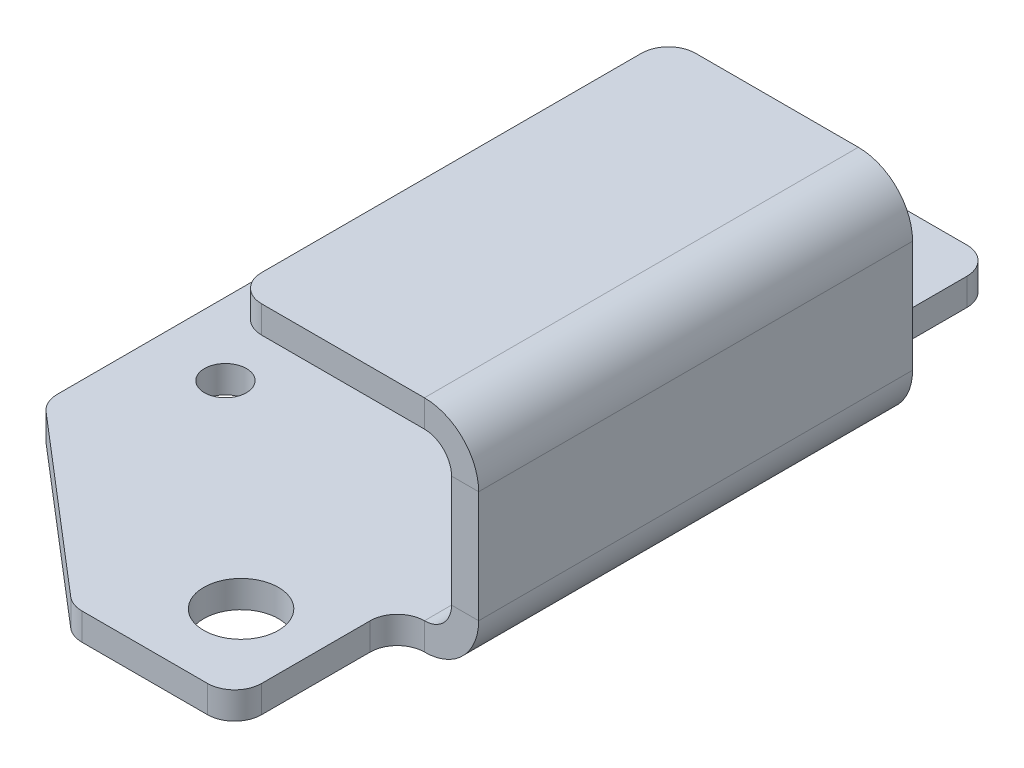
ISO-10303-21;
HEADER;
FILE_DESCRIPTION(('STEP AP214'),'2;1');
FILE_NAME('part.step','',(''),(''),'','','');
FILE_SCHEMA(('AUTOMOTIVE_DESIGN { 1 0 10303 214 1 1 1 1 }'));
ENDSEC;
DATA;
#1=APPLICATION_CONTEXT('core data for automotive mechanical design processes');
#2=APPLICATION_PROTOCOL_DEFINITION('international standard','automotive_design',2000,#1);
#3=PRODUCT_CONTEXT('',#1,'mechanical');
#4=PRODUCT('Part','Part','',(#3));
#5=PRODUCT_RELATED_PRODUCT_CATEGORY('part','',(#4));
#6=PRODUCT_DEFINITION_FORMATION('','',#4);
#7=PRODUCT_DEFINITION_CONTEXT('part definition',#1,'design');
#8=PRODUCT_DEFINITION('design','',#6,#7);
#9=PRODUCT_DEFINITION_SHAPE('','',#8);
#10=(LENGTH_UNIT() NAMED_UNIT(*) SI_UNIT(.MILLI.,.METRE.));
#11=(NAMED_UNIT(*) PLANE_ANGLE_UNIT() SI_UNIT($,.RADIAN.));
#12=(NAMED_UNIT(*) SI_UNIT($,.STERADIAN.) SOLID_ANGLE_UNIT());
#13=UNCERTAINTY_MEASURE_WITH_UNIT(LENGTH_MEASURE(1.E-05),#10,'distance_accuracy_value','');
#14=(GEOMETRIC_REPRESENTATION_CONTEXT(3) GLOBAL_UNCERTAINTY_ASSIGNED_CONTEXT((#13)) GLOBAL_UNIT_ASSIGNED_CONTEXT((#10,
#11,#12)) REPRESENTATION_CONTEXT('',''));
#15=CARTESIAN_POINT('',(0.,0.,0.));
#16=DIRECTION('',(0.,0.,1.));
#17=DIRECTION('',(1.,0.,0.));
#18=AXIS2_PLACEMENT_3D('',#15,#16,#17);
#19=CARTESIAN_POINT('',(25.4,-19.431,25.4));
#20=DIRECTION('',(0.,-1.,0.));
#21=DIRECTION('',(1.,0.,0.));
#22=AXIS2_PLACEMENT_3D('',#19,#20,#21);
#23=PLANE('',#22);
#24=CARTESIAN_POINT('',(-13.7668,-19.431,12.7));
#25=DIRECTION('',(0.,1.,0.));
#26=DIRECTION('',(-1.,0.,0.));
#27=AXIS2_PLACEMENT_3D('',#24,#25,#26);
#28=CIRCLE('',#27,2.45745);
#29=CARTESIAN_POINT('',(-16.22425,-19.431,12.7));
#30=VERTEX_POINT('',#29);
#31=EDGE_CURVE('E887',#30,#30,#28,.T.);
#32=ORIENTED_EDGE('',*,*,#31,.F.);
#33=EDGE_LOOP('',(#32));
#34=FACE_BOUND('',#33,.T.);
#35=CARTESIAN_POINT('',(-13.7668,-19.431,-12.7));
#36=DIRECTION('',(0.,1.,0.));
#37=DIRECTION('',(-1.,0.,0.));
#38=AXIS2_PLACEMENT_3D('',#35,#36,#37);
#39=CIRCLE('',#38,2.45745);
#40=CARTESIAN_POINT('',(-16.22425,-19.431,-12.7));
#41=VERTEX_POINT('',#40);
#42=EDGE_CURVE('E893',#41,#41,#39,.T.);
#43=ORIENTED_EDGE('',*,*,#42,.F.);
#44=EDGE_LOOP('',(#43));
#45=FACE_BOUND('',#44,.T.);
#46=CARTESIAN_POINT('',(10.287,-19.431,34.925));
#47=DIRECTION('',(0.,1.,0.));
#48=DIRECTION('',(-1.,0.,0.));
#49=AXIS2_PLACEMENT_3D('',#46,#47,#48);
#50=CIRCLE('',#49,4.36880000000001);
#51=CARTESIAN_POINT('',(5.9182,-19.431,34.925));
#52=VERTEX_POINT('',#51);
#53=EDGE_CURVE('E935',#52,#52,#50,.T.);
#54=ORIENTED_EDGE('',*,*,#53,.F.);
#55=EDGE_LOOP('',(#54));
#56=FACE_BOUND('',#55,.T.);
#57=CARTESIAN_POINT('',(10.287,-19.431,-34.925));
#58=DIRECTION('',(0.,1.,0.));
#59=DIRECTION('',(-1.,0.,0.));
#60=AXIS2_PLACEMENT_3D('',#57,#58,#59);
#61=CIRCLE('',#60,4.36879999999999);
#62=CARTESIAN_POINT('',(5.91820000000002,-19.431,-34.925));
#63=VERTEX_POINT('',#62);
#64=EDGE_CURVE('E922',#63,#63,#61,.T.);
#65=ORIENTED_EDGE('',*,*,#64,.F.);
#66=EDGE_LOOP('',(#65));
#67=FACE_BOUND('',#66,.T.);
#68=DIRECTION('',(0.759256602365297,0.,0.650791373455969));
#69=VECTOR('',#68,1.);
#70=CARTESIAN_POINT('',(-21.9635294117647,-19.431,25.6241176470588));
#71=LINE('',#70,#69);
#72=CARTESIAN_POINT('',(-21.1162626107227,-19.431,26.3503463336663));
#73=VERTEX_POINT('',#72);
#74=CARTESIAN_POINT('',(-0.891753668738532,-19.431,43.6856397125098));
#75=VERTEX_POINT('',#74);
#76=EDGE_CURVE('E915',#73,#75,#71,.T.);
#77=ORIENTED_EDGE('',*,*,#76,.T.);
#78=CARTESIAN_POINT('',(1.17450894198416,-19.431,41.275));
#79=DIRECTION('',(0.,-1.,0.));
#80=DIRECTION('',(1.,0.,0.));
#81=AXIS2_PLACEMENT_3D('',#78,#79,#80);
#82=CIRCLE('',#81,3.175);
#83=CARTESIAN_POINT('',(1.17450894198416,-19.431,44.45));
#84=VERTEX_POINT('',#83);
#85=EDGE_CURVE('E352',#75,#84,#82,.F.);
#86=ORIENTED_EDGE('',*,*,#85,.T.);
#87=DIRECTION('',(-1.,0.,0.));
#88=VECTOR('',#87,1.);
#89=CARTESIAN_POINT('',(-22.225,-19.431,44.45));
#90=LINE('',#89,#88);
#91=CARTESIAN_POINT('',(15.875,-19.431,44.45));
#92=VERTEX_POINT('',#91);
#93=EDGE_CURVE('E280',#92,#84,#90,.T.);
#94=ORIENTED_EDGE('',*,*,#93,.F.);
#95=CARTESIAN_POINT('',(15.875,-19.431,41.275));
#96=DIRECTION('',(0.,-1.,0.));
#97=DIRECTION('',(1.,0.,0.));
#98=AXIS2_PLACEMENT_3D('',#95,#96,#97);
#99=CIRCLE('',#98,3.175);
#100=CARTESIAN_POINT('',(19.05,-19.431,41.275));
#101=VERTEX_POINT('',#100);
#102=EDGE_CURVE('E342',#92,#101,#99,.F.);
#103=ORIENTED_EDGE('',*,*,#102,.T.);
#104=DIRECTION('',(0.,0.,1.));
#105=VECTOR('',#104,1.);
#106=CARTESIAN_POINT('',(19.05,-19.431,25.4));
#107=LINE('',#106,#105);
#108=CARTESIAN_POINT('',(19.05,-19.431,28.575));
#109=VERTEX_POINT('',#108);
#110=EDGE_CURVE('E903',#109,#101,#107,.T.);
#111=ORIENTED_EDGE('',*,*,#110,.F.);
#112=CARTESIAN_POINT('',(22.225,-19.431,28.575));
#113=DIRECTION('',(0.,-1.,0.));
#114=DIRECTION('',(1.,0.,0.));
#115=AXIS2_PLACEMENT_3D('',#112,#113,#114);
#116=CIRCLE('',#115,3.175);
#117=CARTESIAN_POINT('',(22.225,-19.431,25.4));
#118=VERTEX_POINT('',#117);
#119=EDGE_CURVE('E11',#109,#118,#116,.T.);
#120=ORIENTED_EDGE('',*,*,#119,.T.);
#121=DIRECTION('',(0.,0.,-1.));
#122=VECTOR('',#121,1.);
#123=CARTESIAN_POINT('',(22.225,-19.431,25.4));
#124=LINE('',#123,#122);
#125=CARTESIAN_POINT('',(22.225,-19.431,-25.4));
#126=VERTEX_POINT('',#125);
#127=EDGE_CURVE('E276',#118,#126,#124,.T.);
#128=ORIENTED_EDGE('',*,*,#127,.T.);
#129=CARTESIAN_POINT('',(22.225,-19.431,-28.575));
#130=DIRECTION('',(0.,-1.,0.));
#131=DIRECTION('',(1.,0.,0.));
#132=AXIS2_PLACEMENT_3D('',#129,#130,#131);
#133=CIRCLE('',#132,3.175);
#134=CARTESIAN_POINT('',(19.05,-19.431,-28.575));
#135=VERTEX_POINT('',#134);
#136=EDGE_CURVE('E222',#126,#135,#133,.T.);
#137=ORIENTED_EDGE('',*,*,#136,.T.);
#138=DIRECTION('',(0.,0.,1.));
#139=VECTOR('',#138,1.);
#140=CARTESIAN_POINT('',(19.05,-19.431,-25.4));
#141=LINE('',#140,#139);
#142=CARTESIAN_POINT('',(19.05,-19.431,-41.275));
#143=VERTEX_POINT('',#142);
#144=EDGE_CURVE('E417',#143,#135,#141,.T.);
#145=ORIENTED_EDGE('',*,*,#144,.F.);
#146=CARTESIAN_POINT('',(15.875,-19.431,-41.275));
#147=DIRECTION('',(0.,-1.,0.));
#148=DIRECTION('',(1.,0.,0.));
#149=AXIS2_PLACEMENT_3D('',#146,#147,#148);
#150=CIRCLE('',#149,3.175);
#151=CARTESIAN_POINT('',(15.875,-19.431,-44.45));
#152=VERTEX_POINT('',#151);
#153=EDGE_CURVE('E344',#143,#152,#150,.F.);
#154=ORIENTED_EDGE('',*,*,#153,.T.);
#155=DIRECTION('',(1.,0.,0.));
#156=VECTOR('',#155,1.);
#157=CARTESIAN_POINT('',(-22.225,-19.431,-44.45));
#158=LINE('',#157,#156);
#159=CARTESIAN_POINT('',(1.17450894198416,-19.431,-44.45));
#160=VERTEX_POINT('',#159);
#161=EDGE_CURVE('E426',#160,#152,#158,.T.);
#162=ORIENTED_EDGE('',*,*,#161,.F.);
#163=CARTESIAN_POINT('',(1.17450894198416,-19.431,-41.275));
#164=DIRECTION('',(0.,-1.,0.));
#165=DIRECTION('',(1.,0.,0.));
#166=AXIS2_PLACEMENT_3D('',#163,#164,#165);
#167=CIRCLE('',#166,3.175);
#168=CARTESIAN_POINT('',(-0.891753668738532,-19.431,-43.6856397125098));
#169=VERTEX_POINT('',#168);
#170=EDGE_CURVE('E348',#160,#169,#167,.F.);
#171=ORIENTED_EDGE('',*,*,#170,.T.);
#172=DIRECTION('',(0.759256602365297,0.,-0.650791373455969));
#173=VECTOR('',#172,1.);
#174=CARTESIAN_POINT('',(-21.9635294117647,-19.431,-25.6241176470588));
#175=LINE('',#174,#173);
#176=CARTESIAN_POINT('',(-21.1162626107227,-19.431,-26.3503463336663));
#177=VERTEX_POINT('',#176);
#178=EDGE_CURVE('E925',#177,#169,#175,.T.);
#179=ORIENTED_EDGE('',*,*,#178,.F.);
#180=CARTESIAN_POINT('',(-19.05,-19.431,-23.9397066211564));
#181=DIRECTION('',(0.,-1.,0.));
#182=DIRECTION('',(1.,0.,0.));
#183=AXIS2_PLACEMENT_3D('',#180,#181,#182);
#184=CIRCLE('',#183,3.175);
#185=CARTESIAN_POINT('',(-22.225,-19.431,-23.9397066211564));
#186=VERTEX_POINT('',#185);
#187=EDGE_CURVE('E346',#177,#186,#184,.F.);
#188=ORIENTED_EDGE('',*,*,#187,.T.);
#189=DIRECTION('',(0.,0.,-1.));
#190=VECTOR('',#189,1.);
#191=CARTESIAN_POINT('',(-22.225,-19.431,25.4));
#192=LINE('',#191,#190);
#193=CARTESIAN_POINT('',(-22.225,-19.431,23.9397066211564));
#194=VERTEX_POINT('',#193);
#195=EDGE_CURVE('E319',#194,#186,#192,.T.);
#196=ORIENTED_EDGE('',*,*,#195,.F.);
#197=CARTESIAN_POINT('',(-19.05,-19.431,23.9397066211564));
#198=DIRECTION('',(0.,-1.,0.));
#199=DIRECTION('',(1.,0.,0.));
#200=AXIS2_PLACEMENT_3D('',#197,#198,#199);
#201=CIRCLE('',#200,3.175);
#202=EDGE_CURVE('E350',#194,#73,#201,.F.);
#203=ORIENTED_EDGE('',*,*,#202,.T.);
#204=EDGE_LOOP('',(#77,#86,#94,#103,#111,#120,#128,#137,#145,#154,#162,#171,#179,#188,#196,#203));
#205=FACE_BOUND('',#204,.T.);
#206=ADVANCED_FACE('F38',(#34,#45,#56,#67,#205),#23,.F.);
#207=CARTESIAN_POINT('',(-22.225,-22.606,25.4));
#208=DIRECTION('',(-1.,0.,0.));
#209=DIRECTION('',(0.,0.,1.));
#210=AXIS2_PLACEMENT_3D('',#207,#208,#209);
#211=PLANE('',#210);
#212=DIRECTION('',(0.,0.,-1.));
#213=VECTOR('',#212,1.);
#214=CARTESIAN_POINT('',(-22.225,-22.606,25.4));
#215=LINE('',#214,#213);
#216=CARTESIAN_POINT('',(-22.225,-22.606,23.9397066211564));
#217=VERTEX_POINT('',#216);
#218=CARTESIAN_POINT('',(-22.225,-22.606,-23.9397066211564));
#219=VERTEX_POINT('',#218);
#220=EDGE_CURVE('E245',#217,#219,#215,.T.);
#221=ORIENTED_EDGE('',*,*,#220,.F.);
#222=DIRECTION('',(0.,1.,0.));
#223=VECTOR('',#222,1.);
#224=CARTESIAN_POINT('',(-22.225,-22.606,23.9397066211564));
#225=LINE('',#224,#223);
#226=EDGE_CURVE('E372',#217,#194,#225,.T.);
#227=ORIENTED_EDGE('',*,*,#226,.T.);
#228=ORIENTED_EDGE('',*,*,#195,.T.);
#229=DIRECTION('',(0.,1.,0.));
#230=VECTOR('',#229,1.);
#231=CARTESIAN_POINT('',(-22.225,-22.606,-23.9397066211564));
#232=LINE('',#231,#230);
#233=EDGE_CURVE('E370',#186,#219,#232,.F.);
#234=ORIENTED_EDGE('',*,*,#233,.T.);
#235=EDGE_LOOP('',(#221,#227,#228,#234));
#236=FACE_BOUND('',#235,.T.);
#237=ADVANCED_FACE('F494',(#236),#211,.T.);
#238=CARTESIAN_POINT('',(25.4,-22.606,25.4));
#239=DIRECTION('',(0.,-1.,0.));
#240=DIRECTION('',(1.,0.,0.));
#241=AXIS2_PLACEMENT_3D('',#238,#239,#240);
#242=PLANE('',#241);
#243=CARTESIAN_POINT('',(10.287,-22.606,-34.925));
#244=DIRECTION('',(0.,1.,0.));
#245=DIRECTION('',(-1.,0.,0.));
#246=AXIS2_PLACEMENT_3D('',#243,#244,#245);
#247=CIRCLE('',#246,4.36879999999999);
#248=CARTESIAN_POINT('',(5.91820000000002,-22.606,-34.925));
#249=VERTEX_POINT('',#248);
#250=EDGE_CURVE('E938',#249,#249,#247,.T.);
#251=ORIENTED_EDGE('',*,*,#250,.T.);
#252=EDGE_LOOP('',(#251));
#253=FACE_BOUND('',#252,.T.);
#254=CARTESIAN_POINT('',(10.287,-22.606,34.925));
#255=DIRECTION('',(0.,1.,0.));
#256=DIRECTION('',(-1.,0.,0.));
#257=AXIS2_PLACEMENT_3D('',#254,#255,#256);
#258=CIRCLE('',#257,4.36880000000001);
#259=CARTESIAN_POINT('',(5.9182,-22.606,34.925));
#260=VERTEX_POINT('',#259);
#261=EDGE_CURVE('E932',#260,#260,#258,.T.);
#262=ORIENTED_EDGE('',*,*,#261,.T.);
#263=EDGE_LOOP('',(#262));
#264=FACE_BOUND('',#263,.T.);
#265=CARTESIAN_POINT('',(-13.7668,-22.606,-12.7));
#266=DIRECTION('',(0.,1.,0.));
#267=DIRECTION('',(-1.,0.,0.));
#268=AXIS2_PLACEMENT_3D('',#265,#266,#267);
#269=CIRCLE('',#268,2.45745);
#270=CARTESIAN_POINT('',(-16.22425,-22.606,-12.7));
#271=VERTEX_POINT('',#270);
#272=EDGE_CURVE('E888',#271,#271,#269,.T.);
#273=ORIENTED_EDGE('',*,*,#272,.T.);
#274=EDGE_LOOP('',(#273));
#275=FACE_BOUND('',#274,.T.);
#276=CARTESIAN_POINT('',(-13.7668,-22.606,12.7));
#277=DIRECTION('',(0.,1.,0.));
#278=DIRECTION('',(-1.,0.,0.));
#279=AXIS2_PLACEMENT_3D('',#276,#277,#278);
#280=CIRCLE('',#279,2.45745);
#281=CARTESIAN_POINT('',(-16.22425,-22.606,12.7));
#282=VERTEX_POINT('',#281);
#283=EDGE_CURVE('E885',#282,#282,#280,.T.);
#284=ORIENTED_EDGE('',*,*,#283,.T.);
#285=EDGE_LOOP('',(#284));
#286=FACE_BOUND('',#285,.T.);
#287=DIRECTION('',(-1.,0.,0.));
#288=VECTOR('',#287,1.);
#289=CARTESIAN_POINT('',(-22.225,-22.606,44.45));
#290=LINE('',#289,#288);
#291=CARTESIAN_POINT('',(15.875,-22.606,44.45));
#292=VERTEX_POINT('',#291);
#293=CARTESIAN_POINT('',(1.17450894198416,-22.606,44.45));
#294=VERTEX_POINT('',#293);
#295=EDGE_CURVE('E260',#292,#294,#290,.T.);
#296=ORIENTED_EDGE('',*,*,#295,.T.);
#297=CARTESIAN_POINT('',(1.17450894198416,-22.606,41.275));
#298=DIRECTION('',(0.,-1.,0.));
#299=DIRECTION('',(1.,0.,0.));
#300=AXIS2_PLACEMENT_3D('',#297,#298,#299);
#301=CIRCLE('',#300,3.175);
#302=CARTESIAN_POINT('',(-0.891753668738532,-22.606,43.6856397125098));
#303=VERTEX_POINT('',#302);
#304=EDGE_CURVE('E368',#294,#303,#301,.T.);
#305=ORIENTED_EDGE('',*,*,#304,.T.);
#306=DIRECTION('',(0.759256602365297,0.,0.650791373455969));
#307=VECTOR('',#306,1.);
#308=CARTESIAN_POINT('',(-21.9635294117647,-22.606,25.6241176470588));
#309=LINE('',#308,#307);
#310=CARTESIAN_POINT('',(-21.1162626107227,-22.606,26.3503463336663));
#311=VERTEX_POINT('',#310);
#312=EDGE_CURVE('E917',#311,#303,#309,.T.);
#313=ORIENTED_EDGE('',*,*,#312,.F.);
#314=CARTESIAN_POINT('',(-19.05,-22.606,23.9397066211564));
#315=DIRECTION('',(0.,-1.,0.));
#316=DIRECTION('',(1.,0.,0.));
#317=AXIS2_PLACEMENT_3D('',#314,#315,#316);
#318=CIRCLE('',#317,3.175);
#319=EDGE_CURVE('E366',#311,#217,#318,.T.);
#320=ORIENTED_EDGE('',*,*,#319,.T.);
#321=ORIENTED_EDGE('',*,*,#220,.T.);
#322=CARTESIAN_POINT('',(-19.05,-22.606,-23.9397066211564));
#323=DIRECTION('',(0.,-1.,0.));
#324=DIRECTION('',(1.,0.,0.));
#325=AXIS2_PLACEMENT_3D('',#322,#323,#324);
#326=CIRCLE('',#325,3.175);
#327=CARTESIAN_POINT('',(-21.1162626107227,-22.606,-26.3503463336663));
#328=VERTEX_POINT('',#327);
#329=EDGE_CURVE('E362',#219,#328,#326,.T.);
#330=ORIENTED_EDGE('',*,*,#329,.T.);
#331=DIRECTION('',(0.759256602365297,0.,-0.650791373455969));
#332=VECTOR('',#331,1.);
#333=CARTESIAN_POINT('',(-21.9635294117647,-22.606,-25.6241176470588));
#334=LINE('',#333,#332);
#335=CARTESIAN_POINT('',(-0.891753668738532,-22.606,-43.6856397125098));
#336=VERTEX_POINT('',#335);
#337=EDGE_CURVE('E920',#328,#336,#334,.T.);
#338=ORIENTED_EDGE('',*,*,#337,.T.);
#339=CARTESIAN_POINT('',(1.17450894198416,-22.606,-41.275));
#340=DIRECTION('',(0.,-1.,0.));
#341=DIRECTION('',(1.,0.,0.));
#342=AXIS2_PLACEMENT_3D('',#339,#340,#341);
#343=CIRCLE('',#342,3.175);
#344=CARTESIAN_POINT('',(1.17450894198416,-22.606,-44.45));
#345=VERTEX_POINT('',#344);
#346=EDGE_CURVE('E364',#336,#345,#343,.T.);
#347=ORIENTED_EDGE('',*,*,#346,.T.);
#348=DIRECTION('',(1.,0.,0.));
#349=VECTOR('',#348,1.);
#350=CARTESIAN_POINT('',(-22.225,-22.606,-44.45));
#351=LINE('',#350,#349);
#352=CARTESIAN_POINT('',(15.875,-22.606,-44.45));
#353=VERTEX_POINT('',#352);
#354=EDGE_CURVE('E890',#345,#353,#351,.T.);
#355=ORIENTED_EDGE('',*,*,#354,.T.);
#356=CARTESIAN_POINT('',(15.875,-22.606,-41.275));
#357=DIRECTION('',(0.,-1.,0.));
#358=DIRECTION('',(1.,0.,0.));
#359=AXIS2_PLACEMENT_3D('',#356,#357,#358);
#360=CIRCLE('',#359,3.175);
#361=CARTESIAN_POINT('',(19.05,-22.606,-41.275));
#362=VERTEX_POINT('',#361);
#363=EDGE_CURVE('E360',#353,#362,#360,.T.);
#364=ORIENTED_EDGE('',*,*,#363,.T.);
#365=DIRECTION('',(0.,0.,1.));
#366=VECTOR('',#365,1.);
#367=CARTESIAN_POINT('',(19.05,-22.606,-25.4));
#368=LINE('',#367,#366);
#369=CARTESIAN_POINT('',(19.05,-22.606,-28.575));
#370=VERTEX_POINT('',#369);
#371=EDGE_CURVE('E898',#362,#370,#368,.T.);
#372=ORIENTED_EDGE('',*,*,#371,.T.);
#373=CARTESIAN_POINT('',(22.225,-22.606,-28.575));
#374=DIRECTION('',(0.,-1.,0.));
#375=DIRECTION('',(1.,0.,0.));
#376=AXIS2_PLACEMENT_3D('',#373,#374,#375);
#377=CIRCLE('',#376,3.175);
#378=CARTESIAN_POINT('',(22.225,-22.606,-25.4));
#379=VERTEX_POINT('',#378);
#380=EDGE_CURVE('E241',#370,#379,#377,.F.);
#381=ORIENTED_EDGE('',*,*,#380,.T.);
#382=DIRECTION('',(0.,0.,-1.));
#383=VECTOR('',#382,1.);
#384=CARTESIAN_POINT('',(22.225,-22.606,25.4));
#385=LINE('',#384,#383);
#386=CARTESIAN_POINT('',(22.225,-22.606,25.4));
#387=VERTEX_POINT('',#386);
#388=EDGE_CURVE('E237',#387,#379,#385,.T.);
#389=ORIENTED_EDGE('',*,*,#388,.F.);
#390=CARTESIAN_POINT('',(22.225,-22.606,28.575));
#391=DIRECTION('',(0.,-1.,0.));
#392=DIRECTION('',(1.,0.,0.));
#393=AXIS2_PLACEMENT_3D('',#390,#391,#392);
#394=CIRCLE('',#393,3.175);
#395=CARTESIAN_POINT('',(19.05,-22.606,28.575));
#396=VERTEX_POINT('',#395);
#397=EDGE_CURVE('E46',#387,#396,#394,.F.);
#398=ORIENTED_EDGE('',*,*,#397,.T.);
#399=DIRECTION('',(0.,0.,1.));
#400=VECTOR('',#399,1.);
#401=CARTESIAN_POINT('',(19.05,-22.606,25.4));
#402=LINE('',#401,#400);
#403=CARTESIAN_POINT('',(19.05,-22.606,41.275));
#404=VERTEX_POINT('',#403);
#405=EDGE_CURVE('E425',#396,#404,#402,.T.);
#406=ORIENTED_EDGE('',*,*,#405,.T.);
#407=CARTESIAN_POINT('',(15.875,-22.606,41.275));
#408=DIRECTION('',(0.,-1.,0.));
#409=DIRECTION('',(1.,0.,0.));
#410=AXIS2_PLACEMENT_3D('',#407,#408,#409);
#411=CIRCLE('',#410,3.175);
#412=EDGE_CURVE('E358',#404,#292,#411,.T.);
#413=ORIENTED_EDGE('',*,*,#412,.T.);
#414=EDGE_LOOP('',(#296,#305,#313,#320,#321,#330,#338,#347,#355,#364,#372,#381,#389,#398,#406,#413));
#415=FACE_BOUND('',#414,.T.);
#416=ADVANCED_FACE('F239',(#253,#264,#275,#286,#415),#242,.T.);
#417=CARTESIAN_POINT('',(-22.225,-19.431,44.45));
#418=DIRECTION('',(0.,0.,1.));
#419=DIRECTION('',(1.,0.,0.));
#420=AXIS2_PLACEMENT_3D('',#417,#418,#419);
#421=PLANE('',#420);
#422=ORIENTED_EDGE('',*,*,#93,.T.);
#423=DIRECTION('',(0.,1.,0.));
#424=VECTOR('',#423,1.);
#425=CARTESIAN_POINT('',(1.17450894198416,-19.431,44.45));
#426=LINE('',#425,#424);
#427=EDGE_CURVE('E356',#84,#294,#426,.F.);
#428=ORIENTED_EDGE('',*,*,#427,.T.);
#429=ORIENTED_EDGE('',*,*,#295,.F.);
#430=DIRECTION('',(0.,-1.,0.));
#431=VECTOR('',#430,1.);
#432=CARTESIAN_POINT('',(15.875,-19.431,44.45));
#433=LINE('',#432,#431);
#434=EDGE_CURVE('E354',#292,#92,#433,.F.);
#435=ORIENTED_EDGE('',*,*,#434,.T.);
#436=EDGE_LOOP('',(#422,#428,#429,#435));
#437=FACE_BOUND('',#436,.T.);
#438=ADVANCED_FACE('F520',(#437),#421,.T.);
#439=CARTESIAN_POINT('',(22.225,0.,25.4));
#440=DIRECTION('',(0.,0.,1.));
#441=DIRECTION('',(1.,0.,0.));
#442=AXIS2_PLACEMENT_3D('',#439,#440,#441);
#443=PLANE('',#442);
#444=DIRECTION('',(0.,1.,0.));
#445=VECTOR('',#444,1.);
#446=CARTESIAN_POINT('',(22.225,0.,25.4));
#447=LINE('',#446,#445);
#448=CARTESIAN_POINT('',(22.225,0.,25.4));
#449=VERTEX_POINT('',#448);
#450=CARTESIAN_POINT('',(22.225,3.175,25.4));
#451=VERTEX_POINT('',#450);
#452=EDGE_CURVE('E334',#449,#451,#447,.T.);
#453=ORIENTED_EDGE('',*,*,#452,.F.);
#454=CARTESIAN_POINT('',(22.225,-3.175,25.4));
#455=DIRECTION('',(0.,0.,1.));
#456=DIRECTION('',(1.,0.,0.));
#457=AXIS2_PLACEMENT_3D('',#454,#455,#456);
#458=CIRCLE('',#457,3.175);
#459=CARTESIAN_POINT('',(25.4,-3.175,25.4));
#460=VERTEX_POINT('',#459);
#461=EDGE_CURVE('E269',#449,#460,#458,.F.);
#462=ORIENTED_EDGE('',*,*,#461,.T.);
#463=DIRECTION('',(-1.,0.,0.));
#464=VECTOR('',#463,1.);
#465=CARTESIAN_POINT('',(28.575,-3.175,25.4));
#466=LINE('',#465,#464);
#467=CARTESIAN_POINT('',(28.575,-3.175,25.4));
#468=VERTEX_POINT('',#467);
#469=EDGE_CURVE('E332',#468,#460,#466,.T.);
#470=ORIENTED_EDGE('',*,*,#469,.F.);
#471=CARTESIAN_POINT('',(22.225,-3.175,25.4));
#472=DIRECTION('',(0.,0.,1.));
#473=DIRECTION('',(1.,0.,0.));
#474=AXIS2_PLACEMENT_3D('',#471,#472,#473);
#475=CIRCLE('',#474,6.35);
#476=EDGE_CURVE('E254',#451,#468,#475,.F.);
#477=ORIENTED_EDGE('',*,*,#476,.F.);
#478=EDGE_LOOP('',(#453,#462,#470,#477));
#479=FACE_BOUND('',#478,.T.);
#480=ADVANCED_FACE('F456',(#479),#443,.T.);
#481=CARTESIAN_POINT('',(28.575,-3.175,25.4));
#482=DIRECTION('',(0.,0.,1.));
#483=DIRECTION('',(1.,0.,0.));
#484=AXIS2_PLACEMENT_3D('',#481,#482,#483);
#485=PLANE('',#484);
#486=DIRECTION('',(1.,0.,0.));
#487=VECTOR('',#486,1.);
#488=CARTESIAN_POINT('',(0.,3.175,25.4));
#489=LINE('',#488,#487);
#490=CARTESIAN_POINT('',(3.175,3.175,25.4));
#491=VERTEX_POINT('',#490);
#492=EDGE_CURVE('E265',#491,#451,#489,.T.);
#493=ORIENTED_EDGE('',*,*,#492,.F.);
#494=DIRECTION('',(0.,1.,0.));
#495=VECTOR('',#494,1.);
#496=CARTESIAN_POINT('',(3.175,-3.175,25.4));
#497=LINE('',#496,#495);
#498=CARTESIAN_POINT('',(3.175,0.,25.4));
#499=VERTEX_POINT('',#498);
#500=EDGE_CURVE('E53',#491,#499,#497,.F.);
#501=ORIENTED_EDGE('',*,*,#500,.T.);
#502=DIRECTION('',(1.,0.,0.));
#503=VECTOR('',#502,1.);
#504=CARTESIAN_POINT('',(0.,0.,25.4));
#505=LINE('',#504,#503);
#506=EDGE_CURVE('E267',#499,#449,#505,.T.);
#507=ORIENTED_EDGE('',*,*,#506,.T.);
#508=ORIENTED_EDGE('',*,*,#452,.T.);
#509=EDGE_LOOP('',(#493,#501,#507,#508));
#510=FACE_BOUND('',#509,.T.);
#511=ADVANCED_FACE('F471',(#510),#485,.T.);
#512=CARTESIAN_POINT('',(25.4,-3.175,-25.4));
#513=DIRECTION('',(0.,0.,-1.));
#514=DIRECTION('',(-1.,0.,0.));
#515=AXIS2_PLACEMENT_3D('',#512,#513,#514);
#516=PLANE('',#515);
#517=DIRECTION('',(1.,0.,0.));
#518=VECTOR('',#517,1.);
#519=CARTESIAN_POINT('',(25.4,-3.175,-25.4));
#520=LINE('',#519,#518);
#521=CARTESIAN_POINT('',(25.4,-3.175,-25.4));
#522=VERTEX_POINT('',#521);
#523=CARTESIAN_POINT('',(28.575,-3.175,-25.4));
#524=VERTEX_POINT('',#523);
#525=EDGE_CURVE('E330',#522,#524,#520,.T.);
#526=ORIENTED_EDGE('',*,*,#525,.F.);
#527=CARTESIAN_POINT('',(22.225,-3.175,-25.4));
#528=DIRECTION('',(0.,0.,1.));
#529=DIRECTION('',(1.,0.,0.));
#530=AXIS2_PLACEMENT_3D('',#527,#528,#529);
#531=CIRCLE('',#530,3.175);
#532=CARTESIAN_POINT('',(22.225,0.,-25.4));
#533=VERTEX_POINT('',#532);
#534=EDGE_CURVE('E290',#533,#522,#531,.F.);
#535=ORIENTED_EDGE('',*,*,#534,.F.);
#536=DIRECTION('',(0.,-1.,0.));
#537=VECTOR('',#536,1.);
#538=CARTESIAN_POINT('',(22.225,3.175,-25.4));
#539=LINE('',#538,#537);
#540=CARTESIAN_POINT('',(22.225,3.175,-25.4));
#541=VERTEX_POINT('',#540);
#542=EDGE_CURVE('E327',#541,#533,#539,.T.);
#543=ORIENTED_EDGE('',*,*,#542,.F.);
#544=CARTESIAN_POINT('',(22.225,-3.175,-25.4));
#545=DIRECTION('',(0.,0.,1.));
#546=DIRECTION('',(1.,0.,0.));
#547=AXIS2_PLACEMENT_3D('',#544,#545,#546);
#548=CIRCLE('',#547,6.35);
#549=EDGE_CURVE('E283',#541,#524,#548,.F.);
#550=ORIENTED_EDGE('',*,*,#549,.T.);
#551=EDGE_LOOP('',(#526,#535,#543,#550));
#552=FACE_BOUND('',#551,.T.);
#553=ADVANCED_FACE('F464',(#552),#516,.T.);
#554=CARTESIAN_POINT('',(22.225,3.175,-25.4));
#555=DIRECTION('',(0.,0.,-1.));
#556=DIRECTION('',(-1.,0.,0.));
#557=AXIS2_PLACEMENT_3D('',#554,#555,#556);
#558=PLANE('',#557);
#559=DIRECTION('',(0.,-1.,0.));
#560=VECTOR('',#559,1.);
#561=CARTESIAN_POINT('',(25.4,0.,-25.4));
#562=LINE('',#561,#560);
#563=CARTESIAN_POINT('',(25.4,-16.256,-25.4));
#564=VERTEX_POINT('',#563);
#565=EDGE_CURVE('E257',#522,#564,#562,.T.);
#566=ORIENTED_EDGE('',*,*,#565,.F.);
#567=ORIENTED_EDGE('',*,*,#525,.T.);
#568=DIRECTION('',(0.,-1.,0.));
#569=VECTOR('',#568,1.);
#570=CARTESIAN_POINT('',(28.575,0.,-25.4));
#571=LINE('',#570,#569);
#572=CARTESIAN_POINT('',(28.575,-16.256,-25.4));
#573=VERTEX_POINT('',#572);
#574=EDGE_CURVE('E279',#524,#573,#571,.T.);
#575=ORIENTED_EDGE('',*,*,#574,.T.);
#576=DIRECTION('',(-1.,0.,0.));
#577=VECTOR('',#576,1.);
#578=CARTESIAN_POINT('',(28.575,-16.256,-25.4));
#579=LINE('',#578,#577);
#580=EDGE_CURVE('E322',#573,#564,#579,.T.);
#581=ORIENTED_EDGE('',*,*,#580,.T.);
#582=EDGE_LOOP('',(#566,#567,#575,#581));
#583=FACE_BOUND('',#582,.T.);
#584=ADVANCED_FACE('F441',(#583),#558,.T.);
#585=CARTESIAN_POINT('',(25.4,-16.256,25.4));
#586=DIRECTION('',(0.,0.,1.));
#587=DIRECTION('',(1.,0.,0.));
#588=AXIS2_PLACEMENT_3D('',#585,#586,#587);
#589=PLANE('',#588);
#590=DIRECTION('',(1.,0.,0.));
#591=VECTOR('',#590,1.);
#592=CARTESIAN_POINT('',(25.4,-16.256,25.4));
#593=LINE('',#592,#591);
#594=CARTESIAN_POINT('',(25.4,-16.256,25.4));
#595=VERTEX_POINT('',#594);
#596=CARTESIAN_POINT('',(28.575,-16.256,25.4));
#597=VERTEX_POINT('',#596);
#598=EDGE_CURVE('E233',#595,#597,#593,.T.);
#599=ORIENTED_EDGE('',*,*,#598,.F.);
#600=CARTESIAN_POINT('',(22.225,-16.256,25.4));
#601=DIRECTION('',(0.,0.,1.));
#602=DIRECTION('',(1.,0.,0.));
#603=AXIS2_PLACEMENT_3D('',#600,#601,#602);
#604=CIRCLE('',#603,3.175);
#605=EDGE_CURVE('E231',#595,#118,#604,.F.);
#606=ORIENTED_EDGE('',*,*,#605,.T.);
#607=DIRECTION('',(0.,1.,0.));
#608=VECTOR('',#607,1.);
#609=CARTESIAN_POINT('',(22.225,-22.606,25.4));
#610=LINE('',#609,#608);
#611=EDGE_CURVE('E216',#387,#118,#610,.T.);
#612=ORIENTED_EDGE('',*,*,#611,.F.);
#613=CARTESIAN_POINT('',(22.225,-16.256,25.4));
#614=DIRECTION('',(0.,0.,1.));
#615=DIRECTION('',(1.,0.,0.));
#616=AXIS2_PLACEMENT_3D('',#613,#614,#615);
#617=CIRCLE('',#616,6.35);
#618=EDGE_CURVE('E228',#597,#387,#617,.F.);
#619=ORIENTED_EDGE('',*,*,#618,.F.);
#620=EDGE_LOOP('',(#599,#606,#612,#619));
#621=FACE_BOUND('',#620,.T.);
#622=ADVANCED_FACE('F226',(#621),#589,.T.);
#623=CARTESIAN_POINT('',(22.225,-22.606,25.4));
#624=DIRECTION('',(0.,0.,1.));
#625=DIRECTION('',(1.,0.,0.));
#626=AXIS2_PLACEMENT_3D('',#623,#624,#625);
#627=PLANE('',#626);
#628=DIRECTION('',(0.,-1.,0.));
#629=VECTOR('',#628,1.);
#630=CARTESIAN_POINT('',(25.4,0.,25.4));
#631=LINE('',#630,#629);
#632=EDGE_CURVE('E272',#460,#595,#631,.T.);
#633=ORIENTED_EDGE('',*,*,#632,.T.);
#634=ORIENTED_EDGE('',*,*,#598,.T.);
#635=DIRECTION('',(0.,-1.,0.));
#636=VECTOR('',#635,1.);
#637=CARTESIAN_POINT('',(28.575,0.,25.4));
#638=LINE('',#637,#636);
#639=EDGE_CURVE('E251',#468,#597,#638,.T.);
#640=ORIENTED_EDGE('',*,*,#639,.F.);
#641=ORIENTED_EDGE('',*,*,#469,.T.);
#642=EDGE_LOOP('',(#633,#634,#640,#641));
#643=FACE_BOUND('',#642,.T.);
#644=ADVANCED_FACE('F448',(#643),#627,.T.);
#645=CARTESIAN_POINT('',(22.225,-19.431,-25.4));
#646=DIRECTION('',(0.,0.,-1.));
#647=DIRECTION('',(-1.,0.,0.));
#648=AXIS2_PLACEMENT_3D('',#645,#646,#647);
#649=PLANE('',#648);
#650=DIRECTION('',(0.,-1.,0.));
#651=VECTOR('',#650,1.);
#652=CARTESIAN_POINT('',(22.225,-19.431,-25.4));
#653=LINE('',#652,#651);
#654=EDGE_CURVE('E234',#126,#379,#653,.T.);
#655=ORIENTED_EDGE('',*,*,#654,.F.);
#656=CARTESIAN_POINT('',(22.225,-16.256,-25.4));
#657=DIRECTION('',(0.,0.,1.));
#658=DIRECTION('',(1.,0.,0.));
#659=AXIS2_PLACEMENT_3D('',#656,#657,#658);
#660=CIRCLE('',#659,3.175);
#661=EDGE_CURVE('E252',#564,#126,#660,.F.);
#662=ORIENTED_EDGE('',*,*,#661,.F.);
#663=ORIENTED_EDGE('',*,*,#580,.F.);
#664=CARTESIAN_POINT('',(22.225,-16.256,-25.4));
#665=DIRECTION('',(0.,0.,1.));
#666=DIRECTION('',(1.,0.,0.));
#667=AXIS2_PLACEMENT_3D('',#664,#665,#666);
#668=CIRCLE('',#667,6.35);
#669=EDGE_CURVE('E277',#573,#379,#668,.F.);
#670=ORIENTED_EDGE('',*,*,#669,.T.);
#671=EDGE_LOOP('',(#655,#662,#663,#670));
#672=FACE_BOUND('',#671,.T.);
#673=ADVANCED_FACE('F431',(#672),#649,.T.);
#674=CARTESIAN_POINT('',(22.225,-16.256,25.4));
#675=DIRECTION('',(0.,0.,-1.));
#676=DIRECTION('',(-1.,0.,0.));
#677=AXIS2_PLACEMENT_3D('',#674,#675,#676);
#678=CYLINDRICAL_SURFACE('',#677,6.35);
#679=ORIENTED_EDGE('',*,*,#669,.F.);
#680=DIRECTION('',(0.,0.,-1.));
#681=VECTOR('',#680,1.);
#682=CARTESIAN_POINT('',(28.575,-16.256,25.4));
#683=LINE('',#682,#681);
#684=EDGE_CURVE('E246',#597,#573,#683,.T.);
#685=ORIENTED_EDGE('',*,*,#684,.F.);
#686=ORIENTED_EDGE('',*,*,#618,.T.);
#687=ORIENTED_EDGE('',*,*,#388,.T.);
#688=EDGE_LOOP('',(#679,#685,#686,#687));
#689=FACE_BOUND('',#688,.T.);
#690=ADVANCED_FACE('F249',(#689),#678,.T.);
#691=CARTESIAN_POINT('',(28.575,0.,25.4));
#692=DIRECTION('',(1.,0.,0.));
#693=DIRECTION('',(0.,1.,0.));
#694=AXIS2_PLACEMENT_3D('',#691,#692,#693);
#695=PLANE('',#694);
#696=ORIENTED_EDGE('',*,*,#574,.F.);
#697=DIRECTION('',(0.,0.,-1.));
#698=VECTOR('',#697,1.);
#699=CARTESIAN_POINT('',(28.575,-3.175,25.4));
#700=LINE('',#699,#698);
#701=EDGE_CURVE('E313',#468,#524,#700,.T.);
#702=ORIENTED_EDGE('',*,*,#701,.F.);
#703=ORIENTED_EDGE('',*,*,#639,.T.);
#704=ORIENTED_EDGE('',*,*,#684,.T.);
#705=EDGE_LOOP('',(#696,#702,#703,#704));
#706=FACE_BOUND('',#705,.T.);
#707=ADVANCED_FACE('F444',(#706),#695,.T.);
#708=CARTESIAN_POINT('',(22.225,-3.175,25.4));
#709=DIRECTION('',(0.,0.,-1.));
#710=DIRECTION('',(-1.,0.,0.));
#711=AXIS2_PLACEMENT_3D('',#708,#709,#710);
#712=CYLINDRICAL_SURFACE('',#711,6.35);
#713=ORIENTED_EDGE('',*,*,#549,.F.);
#714=DIRECTION('',(0.,0.,-1.));
#715=VECTOR('',#714,1.);
#716=CARTESIAN_POINT('',(22.225,3.175,25.4));
#717=LINE('',#716,#715);
#718=EDGE_CURVE('E310',#451,#541,#717,.T.);
#719=ORIENTED_EDGE('',*,*,#718,.F.);
#720=ORIENTED_EDGE('',*,*,#476,.T.);
#721=ORIENTED_EDGE('',*,*,#701,.T.);
#722=EDGE_LOOP('',(#713,#719,#720,#721));
#723=FACE_BOUND('',#722,.T.);
#724=ADVANCED_FACE('F453',(#723),#712,.T.);
#725=CARTESIAN_POINT('',(0.,3.175,25.4));
#726=DIRECTION('',(0.,1.,0.));
#727=DIRECTION('',(0.,0.,1.));
#728=AXIS2_PLACEMENT_3D('',#725,#726,#727);
#729=PLANE('',#728);
#730=DIRECTION('',(1.,0.,0.));
#731=VECTOR('',#730,1.);
#732=CARTESIAN_POINT('',(0.,3.175,-25.4));
#733=LINE('',#732,#731);
#734=CARTESIAN_POINT('',(3.175,3.175,-25.4));
#735=VERTEX_POINT('',#734);
#736=EDGE_CURVE('E286',#735,#541,#733,.T.);
#737=ORIENTED_EDGE('',*,*,#736,.F.);
#738=CARTESIAN_POINT('',(3.175,3.175,-22.225));
#739=DIRECTION('',(0.,1.,0.));
#740=DIRECTION('',(0.,0.,1.));
#741=AXIS2_PLACEMENT_3D('',#738,#739,#740);
#742=CIRCLE('',#741,3.175);
#743=CARTESIAN_POINT('',(0.,3.175,-22.225));
#744=VERTEX_POINT('',#743);
#745=EDGE_CURVE('E400',#735,#744,#742,.T.);
#746=ORIENTED_EDGE('',*,*,#745,.T.);
#747=DIRECTION('',(0.,0.,-1.));
#748=VECTOR('',#747,1.);
#749=CARTESIAN_POINT('',(0.,3.175,25.4));
#750=LINE('',#749,#748);
#751=CARTESIAN_POINT('',(0.,3.175,22.225));
#752=VERTEX_POINT('',#751);
#753=EDGE_CURVE('E308',#752,#744,#750,.T.);
#754=ORIENTED_EDGE('',*,*,#753,.F.);
#755=CARTESIAN_POINT('',(3.175,3.175,22.225));
#756=DIRECTION('',(0.,1.,0.));
#757=DIRECTION('',(0.,0.,1.));
#758=AXIS2_PLACEMENT_3D('',#755,#756,#757);
#759=CIRCLE('',#758,3.175);
#760=EDGE_CURVE('E398',#752,#491,#759,.T.);
#761=ORIENTED_EDGE('',*,*,#760,.T.);
#762=ORIENTED_EDGE('',*,*,#492,.T.);
#763=ORIENTED_EDGE('',*,*,#718,.T.);
#764=EDGE_LOOP('',(#737,#746,#754,#761,#762,#763));
#765=FACE_BOUND('',#764,.T.);
#766=ADVANCED_FACE('F469',(#765),#729,.T.);
#767=CARTESIAN_POINT('',(0.,0.,25.4));
#768=DIRECTION('',(-1.,0.,0.));
#769=DIRECTION('',(0.,0.,1.));
#770=AXIS2_PLACEMENT_3D('',#767,#768,#769);
#771=PLANE('',#770);
#772=ORIENTED_EDGE('',*,*,#753,.T.);
#773=DIRECTION('',(0.,1.,0.));
#774=VECTOR('',#773,1.);
#775=CARTESIAN_POINT('',(0.,0.,-22.225));
#776=LINE('',#775,#774);
#777=CARTESIAN_POINT('',(0.,0.,-22.225));
#778=VERTEX_POINT('',#777);
#779=EDGE_CURVE('E61',#744,#778,#776,.F.);
#780=ORIENTED_EDGE('',*,*,#779,.T.);
#781=DIRECTION('',(0.,0.,-1.));
#782=VECTOR('',#781,1.);
#783=CARTESIAN_POINT('',(0.,0.,25.4));
#784=LINE('',#783,#782);
#785=CARTESIAN_POINT('',(0.,0.,22.225));
#786=VERTEX_POINT('',#785);
#787=EDGE_CURVE('E306',#786,#778,#784,.T.);
#788=ORIENTED_EDGE('',*,*,#787,.F.);
#789=DIRECTION('',(0.,1.,0.));
#790=VECTOR('',#789,1.);
#791=CARTESIAN_POINT('',(0.,0.,22.225));
#792=LINE('',#791,#790);
#793=EDGE_CURVE('E402',#786,#752,#792,.T.);
#794=ORIENTED_EDGE('',*,*,#793,.T.);
#795=EDGE_LOOP('',(#772,#780,#788,#794));
#796=FACE_BOUND('',#795,.T.);
#797=ADVANCED_FACE('F477',(#796),#771,.T.);
#798=CARTESIAN_POINT('',(0.,0.,25.4));
#799=DIRECTION('',(0.,1.,0.));
#800=DIRECTION('',(0.,0.,1.));
#801=AXIS2_PLACEMENT_3D('',#798,#799,#800);
#802=PLANE('',#801);
#803=ORIENTED_EDGE('',*,*,#787,.T.);
#804=CARTESIAN_POINT('',(3.175,0.,-22.225));
#805=DIRECTION('',(0.,1.,0.));
#806=DIRECTION('',(0.,0.,1.));
#807=AXIS2_PLACEMENT_3D('',#804,#805,#806);
#808=CIRCLE('',#807,3.175);
#809=CARTESIAN_POINT('',(3.175,0.,-25.4));
#810=VERTEX_POINT('',#809);
#811=EDGE_CURVE('E408',#778,#810,#808,.F.);
#812=ORIENTED_EDGE('',*,*,#811,.T.);
#813=DIRECTION('',(1.,0.,0.));
#814=VECTOR('',#813,1.);
#815=CARTESIAN_POINT('',(0.,0.,-25.4));
#816=LINE('',#815,#814);
#817=EDGE_CURVE('E288',#810,#533,#816,.T.);
#818=ORIENTED_EDGE('',*,*,#817,.T.);
#819=DIRECTION('',(0.,0.,-1.));
#820=VECTOR('',#819,1.);
#821=CARTESIAN_POINT('',(22.225,0.,25.4));
#822=LINE('',#821,#820);
#823=EDGE_CURVE('E303',#449,#533,#822,.T.);
#824=ORIENTED_EDGE('',*,*,#823,.F.);
#825=ORIENTED_EDGE('',*,*,#506,.F.);
#826=CARTESIAN_POINT('',(3.175,0.,22.225));
#827=DIRECTION('',(0.,1.,0.));
#828=DIRECTION('',(0.,0.,1.));
#829=AXIS2_PLACEMENT_3D('',#826,#827,#828);
#830=CIRCLE('',#829,3.175);
#831=EDGE_CURVE('E406',#499,#786,#830,.F.);
#832=ORIENTED_EDGE('',*,*,#831,.T.);
#833=EDGE_LOOP('',(#803,#812,#818,#824,#825,#832));
#834=FACE_BOUND('',#833,.T.);
#835=ADVANCED_FACE('F474',(#834),#802,.F.);
#836=CARTESIAN_POINT('',(22.225,-3.175,25.4));
#837=DIRECTION('',(0.,0.,-1.));
#838=DIRECTION('',(-1.,0.,0.));
#839=AXIS2_PLACEMENT_3D('',#836,#837,#838);
#840=CYLINDRICAL_SURFACE('',#839,3.175);
#841=ORIENTED_EDGE('',*,*,#534,.T.);
#842=DIRECTION('',(0.,0.,-1.));
#843=VECTOR('',#842,1.);
#844=CARTESIAN_POINT('',(25.4,-3.175,25.4));
#845=LINE('',#844,#843);
#846=EDGE_CURVE('E300',#460,#522,#845,.T.);
#847=ORIENTED_EDGE('',*,*,#846,.F.);
#848=ORIENTED_EDGE('',*,*,#461,.F.);
#849=ORIENTED_EDGE('',*,*,#823,.T.);
#850=EDGE_LOOP('',(#841,#847,#848,#849));
#851=FACE_BOUND('',#850,.T.);
#852=ADVANCED_FACE('F460',(#851),#840,.F.);
#853=CARTESIAN_POINT('',(25.4,0.,25.4));
#854=DIRECTION('',(1.,0.,0.));
#855=DIRECTION('',(0.,1.,0.));
#856=AXIS2_PLACEMENT_3D('',#853,#854,#855);
#857=PLANE('',#856);
#858=ORIENTED_EDGE('',*,*,#565,.T.);
#859=DIRECTION('',(0.,0.,-1.));
#860=VECTOR('',#859,1.);
#861=CARTESIAN_POINT('',(25.4,-16.256,25.4));
#862=LINE('',#861,#860);
#863=EDGE_CURVE('E297',#595,#564,#862,.T.);
#864=ORIENTED_EDGE('',*,*,#863,.F.);
#865=ORIENTED_EDGE('',*,*,#632,.F.);
#866=ORIENTED_EDGE('',*,*,#846,.T.);
#867=EDGE_LOOP('',(#858,#864,#865,#866));
#868=FACE_BOUND('',#867,.T.);
#869=ADVANCED_FACE('F437',(#868),#857,.F.);
#870=CARTESIAN_POINT('',(22.225,-16.256,25.4));
#871=DIRECTION('',(0.,0.,-1.));
#872=DIRECTION('',(-1.,0.,0.));
#873=AXIS2_PLACEMENT_3D('',#870,#871,#872);
#874=CYLINDRICAL_SURFACE('',#873,3.175);
#875=ORIENTED_EDGE('',*,*,#661,.T.);
#876=ORIENTED_EDGE('',*,*,#127,.F.);
#877=ORIENTED_EDGE('',*,*,#605,.F.);
#878=ORIENTED_EDGE('',*,*,#863,.T.);
#879=EDGE_LOOP('',(#875,#876,#877,#878));
#880=FACE_BOUND('',#879,.T.);
#881=ADVANCED_FACE('F433',(#880),#874,.F.);
#882=CARTESIAN_POINT('',(22.225,-16.256,-25.4));
#883=DIRECTION('',(0.,0.,1.));
#884=DIRECTION('',(1.,0.,0.));
#885=AXIS2_PLACEMENT_3D('',#882,#883,#884);
#886=PLANE('',#885);
#887=ORIENTED_EDGE('',*,*,#817,.F.);
#888=DIRECTION('',(0.,1.,0.));
#889=VECTOR('',#888,1.);
#890=CARTESIAN_POINT('',(3.175,3.175,-25.4));
#891=LINE('',#890,#889);
#892=EDGE_CURVE('E395',#810,#735,#891,.T.);
#893=ORIENTED_EDGE('',*,*,#892,.T.);
#894=ORIENTED_EDGE('',*,*,#736,.T.);
#895=ORIENTED_EDGE('',*,*,#542,.T.);
#896=EDGE_LOOP('',(#887,#893,#894,#895));
#897=FACE_BOUND('',#896,.T.);
#898=ADVANCED_FACE('F482',(#897),#886,.F.);
#899=CARTESIAN_POINT('',(19.05,-19.431,25.4));
#900=DIRECTION('',(1.,0.,0.));
#901=DIRECTION('',(0.,1.,0.));
#902=AXIS2_PLACEMENT_3D('',#899,#900,#901);
#903=PLANE('',#902);
#904=ORIENTED_EDGE('',*,*,#405,.F.);
#905=DIRECTION('',(0.,-1.,0.));
#906=VECTOR('',#905,1.);
#907=CARTESIAN_POINT('',(19.05,-19.431,28.575));
#908=LINE('',#907,#906);
#909=EDGE_CURVE('E217',#396,#109,#908,.F.);
#910=ORIENTED_EDGE('',*,*,#909,.T.);
#911=ORIENTED_EDGE('',*,*,#110,.T.);
#912=DIRECTION('',(0.,-1.,0.));
#913=VECTOR('',#912,1.);
#914=CARTESIAN_POINT('',(19.05,-19.431,41.275));
#915=LINE('',#914,#913);
#916=EDGE_CURVE('E391',#101,#404,#915,.T.);
#917=ORIENTED_EDGE('',*,*,#916,.T.);
#918=EDGE_LOOP('',(#904,#910,#911,#917));
#919=FACE_BOUND('',#918,.T.);
#920=ADVANCED_FACE('F484',(#919),#903,.T.);
#921=CARTESIAN_POINT('',(19.05,-19.431,-25.4));
#922=DIRECTION('',(1.,0.,0.));
#923=DIRECTION('',(0.,1.,0.));
#924=AXIS2_PLACEMENT_3D('',#921,#922,#923);
#925=PLANE('',#924);
#926=ORIENTED_EDGE('',*,*,#144,.T.);
#927=DIRECTION('',(0.,-1.,0.));
#928=VECTOR('',#927,1.);
#929=CARTESIAN_POINT('',(19.05,-22.606,-28.575));
#930=LINE('',#929,#928);
#931=EDGE_CURVE('E388',#135,#370,#930,.T.);
#932=ORIENTED_EDGE('',*,*,#931,.T.);
#933=ORIENTED_EDGE('',*,*,#371,.F.);
#934=DIRECTION('',(0.,-1.,0.));
#935=VECTOR('',#934,1.);
#936=CARTESIAN_POINT('',(19.05,-19.431,-41.275));
#937=LINE('',#936,#935);
#938=EDGE_CURVE('E386',#362,#143,#937,.F.);
#939=ORIENTED_EDGE('',*,*,#938,.T.);
#940=EDGE_LOOP('',(#926,#932,#933,#939));
#941=FACE_BOUND('',#940,.T.);
#942=ADVANCED_FACE('F422',(#941),#925,.T.);
#943=CARTESIAN_POINT('',(-22.225,-19.431,-44.45));
#944=DIRECTION('',(0.,0.,-1.));
#945=DIRECTION('',(-1.,0.,0.));
#946=AXIS2_PLACEMENT_3D('',#943,#944,#945);
#947=PLANE('',#946);
#948=ORIENTED_EDGE('',*,*,#354,.F.);
#949=DIRECTION('',(0.,1.,0.));
#950=VECTOR('',#949,1.);
#951=CARTESIAN_POINT('',(1.17450894198416,-19.431,-44.45));
#952=LINE('',#951,#950);
#953=EDGE_CURVE('E378',#345,#160,#952,.T.);
#954=ORIENTED_EDGE('',*,*,#953,.T.);
#955=ORIENTED_EDGE('',*,*,#161,.T.);
#956=DIRECTION('',(0.,-1.,0.));
#957=VECTOR('',#956,1.);
#958=CARTESIAN_POINT('',(15.875,-19.431,-44.45));
#959=LINE('',#958,#957);
#960=EDGE_CURVE('E375',#152,#353,#959,.T.);
#961=ORIENTED_EDGE('',*,*,#960,.T.);
#962=EDGE_LOOP('',(#948,#954,#955,#961));
#963=FACE_BOUND('',#962,.T.);
#964=ADVANCED_FACE('F636',(#963),#947,.T.);
#965=CARTESIAN_POINT('',(-13.7668,-22.606,12.7));
#966=DIRECTION('',(0.,1.,0.));
#967=DIRECTION('',(-1.,0.,0.));
#968=AXIS2_PLACEMENT_3D('',#965,#966,#967);
#969=CYLINDRICAL_SURFACE('',#968,2.45745);
#970=ORIENTED_EDGE('',*,*,#283,.F.);
#971=EDGE_LOOP('',(#970));
#972=FACE_BOUND('',#971,.T.);
#973=ORIENTED_EDGE('',*,*,#31,.T.);
#974=EDGE_LOOP('',(#973));
#975=FACE_BOUND('',#974,.T.);
#976=ADVANCED_FACE('F641',(#972,#975),#969,.F.);
#977=CARTESIAN_POINT('',(-13.7668,-22.606,-12.7));
#978=DIRECTION('',(0.,1.,0.));
#979=DIRECTION('',(-1.,0.,0.));
#980=AXIS2_PLACEMENT_3D('',#977,#978,#979);
#981=CYLINDRICAL_SURFACE('',#980,2.45745);
#982=ORIENTED_EDGE('',*,*,#272,.F.);
#983=EDGE_LOOP('',(#982));
#984=FACE_BOUND('',#983,.T.);
#985=ORIENTED_EDGE('',*,*,#42,.T.);
#986=EDGE_LOOP('',(#985));
#987=FACE_BOUND('',#986,.T.);
#988=ADVANCED_FACE('F785',(#984,#987),#981,.F.);
#989=CARTESIAN_POINT('',(10.287,-22.606,34.925));
#990=DIRECTION('',(0.,1.,0.));
#991=DIRECTION('',(-1.,0.,0.));
#992=AXIS2_PLACEMENT_3D('',#989,#990,#991);
#993=CYLINDRICAL_SURFACE('',#992,4.36880000000001);
#994=ORIENTED_EDGE('',*,*,#261,.F.);
#995=EDGE_LOOP('',(#994));
#996=FACE_BOUND('',#995,.T.);
#997=ORIENTED_EDGE('',*,*,#53,.T.);
#998=EDGE_LOOP('',(#997));
#999=FACE_BOUND('',#998,.T.);
#1000=ADVANCED_FACE('F775',(#996,#999),#993,.F.);
#1001=CARTESIAN_POINT('',(10.287,-22.606,-34.925));
#1002=DIRECTION('',(0.,1.,0.));
#1003=DIRECTION('',(-1.,0.,0.));
#1004=AXIS2_PLACEMENT_3D('',#1001,#1002,#1003);
#1005=CYLINDRICAL_SURFACE('',#1004,4.36879999999999);
#1006=ORIENTED_EDGE('',*,*,#250,.F.);
#1007=EDGE_LOOP('',(#1006));
#1008=FACE_BOUND('',#1007,.T.);
#1009=ORIENTED_EDGE('',*,*,#64,.T.);
#1010=EDGE_LOOP('',(#1009));
#1011=FACE_BOUND('',#1010,.T.);
#1012=ADVANCED_FACE('F627',(#1008,#1011),#1005,.F.);
#1013=CARTESIAN_POINT('',(-21.9635294117647,-22.606,-25.6241176470588));
#1014=DIRECTION('',(0.650791373455969,0.,0.759256602365297));
#1015=DIRECTION('',(0.759256602365297,0.,-0.650791373455969));
#1016=AXIS2_PLACEMENT_3D('',#1013,#1014,#1015);
#1017=PLANE('',#1016);
#1018=ORIENTED_EDGE('',*,*,#178,.T.);
#1019=DIRECTION('',(0.,1.,0.));
#1020=VECTOR('',#1019,1.);
#1021=CARTESIAN_POINT('',(-0.891753668738538,-22.606,-43.6856397125098));
#1022=LINE('',#1021,#1020);
#1023=EDGE_CURVE('E384',#169,#336,#1022,.F.);
#1024=ORIENTED_EDGE('',*,*,#1023,.T.);
#1025=ORIENTED_EDGE('',*,*,#337,.F.);
#1026=DIRECTION('',(0.,1.,0.));
#1027=VECTOR('',#1026,1.);
#1028=CARTESIAN_POINT('',(-21.1162626107227,-19.431,-26.3503463336663));
#1029=LINE('',#1028,#1027);
#1030=EDGE_CURVE('E381',#328,#177,#1029,.T.);
#1031=ORIENTED_EDGE('',*,*,#1030,.T.);
#1032=EDGE_LOOP('',(#1018,#1024,#1025,#1031));
#1033=FACE_BOUND('',#1032,.T.);
#1034=ADVANCED_FACE('F616',(#1033),#1017,.F.);
#1035=CARTESIAN_POINT('',(-21.9635294117647,-22.606,25.6241176470588));
#1036=DIRECTION('',(-0.650791373455969,0.,0.759256602365297));
#1037=DIRECTION('',(0.759256602365297,0.,0.650791373455969));
#1038=AXIS2_PLACEMENT_3D('',#1035,#1036,#1037);
#1039=PLANE('',#1038);
#1040=ORIENTED_EDGE('',*,*,#312,.T.);
#1041=DIRECTION('',(0.,1.,0.));
#1042=VECTOR('',#1041,1.);
#1043=CARTESIAN_POINT('',(-0.891753668738535,-22.606,43.6856397125098));
#1044=LINE('',#1043,#1042);
#1045=EDGE_CURVE('E339',#303,#75,#1044,.T.);
#1046=ORIENTED_EDGE('',*,*,#1045,.T.);
#1047=ORIENTED_EDGE('',*,*,#76,.F.);
#1048=DIRECTION('',(0.,1.,0.));
#1049=VECTOR('',#1048,1.);
#1050=CARTESIAN_POINT('',(-21.1162626107227,-22.606,26.3503463336663));
#1051=LINE('',#1050,#1049);
#1052=EDGE_CURVE('E337',#73,#311,#1051,.F.);
#1053=ORIENTED_EDGE('',*,*,#1052,.T.);
#1054=EDGE_LOOP('',(#1040,#1046,#1047,#1053));
#1055=FACE_BOUND('',#1054,.T.);
#1056=ADVANCED_FACE('F525',(#1055),#1039,.T.);
#1057=CARTESIAN_POINT('',(1.17450894198416,-22.606,41.275));
#1058=DIRECTION('',(0.,1.,0.));
#1059=DIRECTION('',(-1.,0.,0.));
#1060=AXIS2_PLACEMENT_3D('',#1057,#1058,#1059);
#1061=CYLINDRICAL_SURFACE('',#1060,3.175);
#1062=ORIENTED_EDGE('',*,*,#304,.F.);
#1063=ORIENTED_EDGE('',*,*,#427,.F.);
#1064=ORIENTED_EDGE('',*,*,#85,.F.);
#1065=ORIENTED_EDGE('',*,*,#1045,.F.);
#1066=EDGE_LOOP('',(#1062,#1063,#1064,#1065));
#1067=FACE_BOUND('',#1066,.T.);
#1068=ADVANCED_FACE('F521',(#1067),#1061,.T.);
#1069=CARTESIAN_POINT('',(-19.05,-22.606,23.9397066211564));
#1070=DIRECTION('',(0.,1.,0.));
#1071=DIRECTION('',(0.,0.,1.));
#1072=AXIS2_PLACEMENT_3D('',#1069,#1070,#1071);
#1073=CYLINDRICAL_SURFACE('',#1072,3.175);
#1074=ORIENTED_EDGE('',*,*,#319,.F.);
#1075=ORIENTED_EDGE('',*,*,#1052,.F.);
#1076=ORIENTED_EDGE('',*,*,#202,.F.);
#1077=ORIENTED_EDGE('',*,*,#226,.F.);
#1078=EDGE_LOOP('',(#1074,#1075,#1076,#1077));
#1079=FACE_BOUND('',#1078,.T.);
#1080=ADVANCED_FACE('F524',(#1079),#1073,.T.);
#1081=CARTESIAN_POINT('',(1.17450894198416,-19.431,-41.275));
#1082=DIRECTION('',(0.,-1.,0.));
#1083=DIRECTION('',(1.,0.,0.));
#1084=AXIS2_PLACEMENT_3D('',#1081,#1082,#1083);
#1085=CYLINDRICAL_SURFACE('',#1084,3.175);
#1086=ORIENTED_EDGE('',*,*,#346,.F.);
#1087=ORIENTED_EDGE('',*,*,#1023,.F.);
#1088=ORIENTED_EDGE('',*,*,#170,.F.);
#1089=ORIENTED_EDGE('',*,*,#953,.F.);
#1090=EDGE_LOOP('',(#1086,#1087,#1088,#1089));
#1091=FACE_BOUND('',#1090,.T.);
#1092=ADVANCED_FACE('F529',(#1091),#1085,.T.);
#1093=CARTESIAN_POINT('',(-19.05,-22.606,-23.9397066211564));
#1094=DIRECTION('',(0.,-1.,0.));
#1095=DIRECTION('',(0.,0.,-1.));
#1096=AXIS2_PLACEMENT_3D('',#1093,#1094,#1095);
#1097=CYLINDRICAL_SURFACE('',#1096,3.175);
#1098=ORIENTED_EDGE('',*,*,#329,.F.);
#1099=ORIENTED_EDGE('',*,*,#233,.F.);
#1100=ORIENTED_EDGE('',*,*,#187,.F.);
#1101=ORIENTED_EDGE('',*,*,#1030,.F.);
#1102=EDGE_LOOP('',(#1098,#1099,#1100,#1101));
#1103=FACE_BOUND('',#1102,.T.);
#1104=ADVANCED_FACE('F533',(#1103),#1097,.T.);
#1105=CARTESIAN_POINT('',(22.225,-19.431,-28.575));
#1106=DIRECTION('',(0.,1.,0.));
#1107=DIRECTION('',(-1.,0.,0.));
#1108=AXIS2_PLACEMENT_3D('',#1105,#1106,#1107);
#1109=CYLINDRICAL_SURFACE('',#1108,3.175);
#1110=ORIENTED_EDGE('',*,*,#136,.F.);
#1111=ORIENTED_EDGE('',*,*,#654,.T.);
#1112=ORIENTED_EDGE('',*,*,#380,.F.);
#1113=ORIENTED_EDGE('',*,*,#931,.F.);
#1114=EDGE_LOOP('',(#1110,#1111,#1112,#1113));
#1115=FACE_BOUND('',#1114,.T.);
#1116=ADVANCED_FACE('F428',(#1115),#1109,.F.);
#1117=CARTESIAN_POINT('',(22.225,-16.256,28.575));
#1118=DIRECTION('',(0.,1.,0.));
#1119=DIRECTION('',(-1.,0.,0.));
#1120=AXIS2_PLACEMENT_3D('',#1117,#1118,#1119);
#1121=CYLINDRICAL_SURFACE('',#1120,3.175);
#1122=ORIENTED_EDGE('',*,*,#119,.F.);
#1123=ORIENTED_EDGE('',*,*,#909,.F.);
#1124=ORIENTED_EDGE('',*,*,#397,.F.);
#1125=ORIENTED_EDGE('',*,*,#611,.T.);
#1126=EDGE_LOOP('',(#1122,#1123,#1124,#1125));
#1127=FACE_BOUND('',#1126,.T.);
#1128=ADVANCED_FACE('F215',(#1127),#1121,.F.);
#1129=CARTESIAN_POINT('',(15.875,-19.431,-41.275));
#1130=DIRECTION('',(0.,-1.,0.));
#1131=DIRECTION('',(1.,0.,0.));
#1132=AXIS2_PLACEMENT_3D('',#1129,#1130,#1131);
#1133=CYLINDRICAL_SURFACE('',#1132,3.175);
#1134=ORIENTED_EDGE('',*,*,#153,.F.);
#1135=ORIENTED_EDGE('',*,*,#938,.F.);
#1136=ORIENTED_EDGE('',*,*,#363,.F.);
#1137=ORIENTED_EDGE('',*,*,#960,.F.);
#1138=EDGE_LOOP('',(#1134,#1135,#1136,#1137));
#1139=FACE_BOUND('',#1138,.T.);
#1140=ADVANCED_FACE('F542',(#1139),#1133,.T.);
#1141=CARTESIAN_POINT('',(15.875,-19.431,41.275));
#1142=DIRECTION('',(0.,-1.,0.));
#1143=DIRECTION('',(1.,0.,0.));
#1144=AXIS2_PLACEMENT_3D('',#1141,#1142,#1143);
#1145=CYLINDRICAL_SURFACE('',#1144,3.175);
#1146=ORIENTED_EDGE('',*,*,#102,.F.);
#1147=ORIENTED_EDGE('',*,*,#434,.F.);
#1148=ORIENTED_EDGE('',*,*,#412,.F.);
#1149=ORIENTED_EDGE('',*,*,#916,.F.);
#1150=EDGE_LOOP('',(#1146,#1147,#1148,#1149));
#1151=FACE_BOUND('',#1150,.T.);
#1152=ADVANCED_FACE('F545',(#1151),#1145,.T.);
#1153=CARTESIAN_POINT('',(3.175,-16.256,-22.225));
#1154=DIRECTION('',(0.,-1.,0.));
#1155=DIRECTION('',(0.,0.,-1.));
#1156=AXIS2_PLACEMENT_3D('',#1153,#1154,#1155);
#1157=CYLINDRICAL_SURFACE('',#1156,3.175);
#1158=ORIENTED_EDGE('',*,*,#811,.F.);
#1159=ORIENTED_EDGE('',*,*,#779,.F.);
#1160=ORIENTED_EDGE('',*,*,#745,.F.);
#1161=ORIENTED_EDGE('',*,*,#892,.F.);
#1162=EDGE_LOOP('',(#1158,#1159,#1160,#1161));
#1163=FACE_BOUND('',#1162,.T.);
#1164=ADVANCED_FACE('F481',(#1163),#1157,.T.);
#1165=CARTESIAN_POINT('',(3.175,0.,22.225));
#1166=DIRECTION('',(0.,1.,0.));
#1167=DIRECTION('',(0.,0.,1.));
#1168=AXIS2_PLACEMENT_3D('',#1165,#1166,#1167);
#1169=CYLINDRICAL_SURFACE('',#1168,3.175);
#1170=ORIENTED_EDGE('',*,*,#831,.F.);
#1171=ORIENTED_EDGE('',*,*,#500,.F.);
#1172=ORIENTED_EDGE('',*,*,#760,.F.);
#1173=ORIENTED_EDGE('',*,*,#793,.F.);
#1174=EDGE_LOOP('',(#1170,#1171,#1172,#1173));
#1175=FACE_BOUND('',#1174,.T.);
#1176=ADVANCED_FACE('F40',(#1175),#1169,.T.);
#1177=CLOSED_SHELL('',(#206,#237,#416,#438,#480,#511,#553,#584,#622,#644,#673,#690,#707,#724,
#766,#797,#835,#852,#869,#881,#898,#920,#942,#964,#976,#988,#1000,#1012,#1034,#1056,#1068,#1080,
#1092,#1104,#1116,#1128,#1140,#1152,#1164,#1176));
#1178=MANIFOLD_SOLID_BREP('B2',#1177);
#1179=ADVANCED_BREP_SHAPE_REPRESENTATION('',(#18,#1178),#14);
#1180=SHAPE_DEFINITION_REPRESENTATION(#9,#1179);
ENDSEC;
END-ISO-10303-21;
